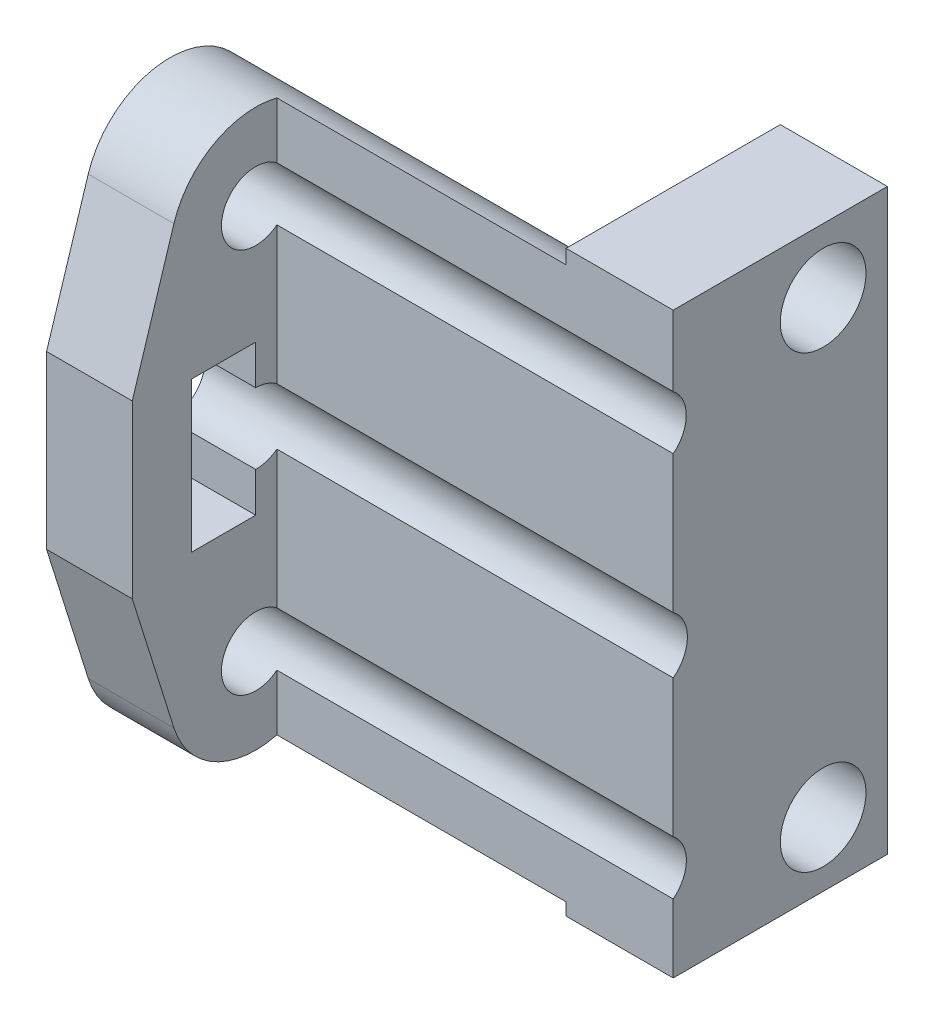
ISO-10303-21;
HEADER;
FILE_DESCRIPTION(('STEP AP214'),'2;1');
FILE_NAME('part.step','',(''),(''),'','','');
FILE_SCHEMA(('AUTOMOTIVE_DESIGN { 1 0 10303 214 1 1 1 1 }'));
ENDSEC;
DATA;
#1=APPLICATION_CONTEXT('core data for automotive mechanical design processes');
#2=APPLICATION_PROTOCOL_DEFINITION('international standard','automotive_design',2000,#1);
#3=PRODUCT_CONTEXT('',#1,'mechanical');
#4=PRODUCT('Part','Part','',(#3));
#5=PRODUCT_RELATED_PRODUCT_CATEGORY('part','',(#4));
#6=PRODUCT_DEFINITION_FORMATION('','',#4);
#7=PRODUCT_DEFINITION_CONTEXT('part definition',#1,'design');
#8=PRODUCT_DEFINITION('design','',#6,#7);
#9=PRODUCT_DEFINITION_SHAPE('','',#8);
#10=(LENGTH_UNIT() NAMED_UNIT(*) SI_UNIT(.MILLI.,.METRE.));
#11=(NAMED_UNIT(*) PLANE_ANGLE_UNIT() SI_UNIT($,.RADIAN.));
#12=(NAMED_UNIT(*) SI_UNIT($,.STERADIAN.) SOLID_ANGLE_UNIT());
#13=UNCERTAINTY_MEASURE_WITH_UNIT(LENGTH_MEASURE(1.E-05),#10,'distance_accuracy_value','');
#14=(GEOMETRIC_REPRESENTATION_CONTEXT(3) GLOBAL_UNCERTAINTY_ASSIGNED_CONTEXT((#13)) GLOBAL_UNIT_ASSIGNED_CONTEXT((#10,
#11,#12)) REPRESENTATION_CONTEXT('',''));
#15=CARTESIAN_POINT('',(0.,0.,0.));
#16=DIRECTION('',(0.,0.,1.));
#17=DIRECTION('',(1.,0.,0.));
#18=AXIS2_PLACEMENT_3D('',#15,#16,#17);
#19=CARTESIAN_POINT('',(0.,0.,4.));
#20=DIRECTION('',(0.,0.,1.));
#21=DIRECTION('',(1.,0.,0.));
#22=AXIS2_PLACEMENT_3D('',#19,#20,#21);
#23=PLANE('',#22);
#24=DIRECTION('',(-1.,0.,0.));
#25=VECTOR('',#24,1.);
#26=CARTESIAN_POINT('',(5.,212.675960946717,4.));
#27=LINE('',#26,#25);
#28=CARTESIAN_POINT('',(5.,212.675960946717,4.));
#29=VERTEX_POINT('',#28);
#30=CARTESIAN_POINT('',(-13.5,212.675960946717,4.));
#31=VERTEX_POINT('',#30);
#32=EDGE_CURVE('E258',#29,#31,#27,.T.);
#33=ORIENTED_EDGE('',*,*,#32,.F.);
#34=DIRECTION('',(0.,1.,0.));
#35=VECTOR('',#34,1.);
#36=CARTESIAN_POINT('',(5.,215.968429512973,4.));
#37=LINE('',#36,#35);
#38=CARTESIAN_POINT('',(5.,215.968429512973,4.));
#39=VERTEX_POINT('',#38);
#40=EDGE_CURVE('E335',#29,#39,#37,.T.);
#41=ORIENTED_EDGE('',*,*,#40,.T.);
#42=DIRECTION('',(-1.,0.,0.));
#43=VECTOR('',#42,1.);
#44=CARTESIAN_POINT('',(0.,215.968429512973,4.));
#45=LINE('',#44,#43);
#46=CARTESIAN_POINT('',(0.,215.968429512973,4.));
#47=VERTEX_POINT('',#46);
#48=EDGE_CURVE('E339',#39,#47,#45,.T.);
#49=ORIENTED_EDGE('',*,*,#48,.T.);
#50=DIRECTION('',(0.,-1.,0.));
#51=VECTOR('',#50,1.);
#52=CARTESIAN_POINT('',(0.,0.,4.));
#53=LINE('',#52,#51);
#54=CARTESIAN_POINT('',(0.,215.298948749305,4.));
#55=VERTEX_POINT('',#54);
#56=EDGE_CURVE('E313',#47,#55,#53,.T.);
#57=ORIENTED_EDGE('',*,*,#56,.T.);
#58=DIRECTION('',(-1.,0.,0.));
#59=VECTOR('',#58,1.);
#60=CARTESIAN_POINT('',(0.,215.298948749305,4.));
#61=LINE('',#60,#59);
#62=CARTESIAN_POINT('',(-13.5,215.298948749305,4.));
#63=VERTEX_POINT('',#62);
#64=EDGE_CURVE('E308',#63,#55,#61,.F.);
#65=ORIENTED_EDGE('',*,*,#64,.F.);
#66=DIRECTION('',(0.,1.,0.));
#67=VECTOR('',#66,1.);
#68=CARTESIAN_POINT('',(-13.5,215.968429512973,4.));
#69=LINE('',#68,#67);
#70=EDGE_CURVE('E316',#31,#63,#69,.T.);
#71=ORIENTED_EDGE('',*,*,#70,.F.);
#72=EDGE_LOOP('',(#33,#41,#49,#57,#65,#71));
#73=FACE_BOUND('',#72,.T.);
#74=ADVANCED_FACE('F33',(#73),#23,.T.);
#75=DIRECTION('',(-1.,0.,0.));
#76=VECTOR('',#75,1.);
#77=CARTESIAN_POINT('',(5.,194.682773282847,4.));
#78=LINE('',#77,#76);
#79=CARTESIAN_POINT('',(5.,194.682773282847,4.));
#80=VERTEX_POINT('',#79);
#81=CARTESIAN_POINT('',(-13.5,194.682773282847,4.));
#82=VERTEX_POINT('',#81);
#83=EDGE_CURVE('E254',#80,#82,#78,.T.);
#84=ORIENTED_EDGE('',*,*,#83,.F.);
#85=CARTESIAN_POINT('',(5.,201.101680385271,4.));
#86=VERTEX_POINT('',#85);
#87=EDGE_CURVE('E340',#80,#86,#37,.T.);
#88=ORIENTED_EDGE('',*,*,#87,.T.);
#89=DIRECTION('',(-1.,0.,0.));
#90=VECTOR('',#89,1.);
#91=CARTESIAN_POINT('',(5.,201.101680385271,4.));
#92=LINE('',#91,#90);
#93=CARTESIAN_POINT('',(-13.5,201.101680385271,4.));
#94=VERTEX_POINT('',#93);
#95=EDGE_CURVE('E242',#94,#86,#92,.F.);
#96=ORIENTED_EDGE('',*,*,#95,.F.);
#97=EDGE_CURVE('E327',#82,#94,#69,.T.);
#98=ORIENTED_EDGE('',*,*,#97,.F.);
#99=EDGE_LOOP('',(#84,#88,#96,#98));
#100=FACE_BOUND('',#99,.T.);
#101=ADVANCED_FACE('F430',(#100),#23,.T.);
#102=DIRECTION('',(-1.,0.,0.));
#103=VECTOR('',#102,1.);
#104=CARTESIAN_POINT('',(5.,210.166663095721,4.));
#105=LINE('',#104,#103);
#106=CARTESIAN_POINT('',(-13.5,210.166663095721,4.));
#107=VERTEX_POINT('',#106);
#108=CARTESIAN_POINT('',(5.,210.166663095721,4.));
#109=VERTEX_POINT('',#108);
#110=EDGE_CURVE('E256',#107,#109,#105,.F.);
#111=ORIENTED_EDGE('',*,*,#110,.F.);
#112=CARTESIAN_POINT('',(-13.5,203.744996753809,4.));
#113=VERTEX_POINT('',#112);
#114=EDGE_CURVE('E458',#113,#107,#69,.T.);
#115=ORIENTED_EDGE('',*,*,#114,.F.);
#116=DIRECTION('',(-1.,0.,0.));
#117=VECTOR('',#116,1.);
#118=CARTESIAN_POINT('',(5.,203.744996753809,4.));
#119=LINE('',#118,#117);
#120=CARTESIAN_POINT('',(5.,203.744996753809,4.));
#121=VERTEX_POINT('',#120);
#122=EDGE_CURVE('E250',#121,#113,#119,.T.);
#123=ORIENTED_EDGE('',*,*,#122,.F.);
#124=EDGE_CURVE('E425',#121,#109,#37,.T.);
#125=ORIENTED_EDGE('',*,*,#124,.T.);
#126=EDGE_LOOP('',(#111,#115,#123,#125));
#127=FACE_BOUND('',#126,.T.);
#128=ADVANCED_FACE('F520',(#127),#23,.T.);
#129=CARTESIAN_POINT('',(0.,215.968429512973,-5.99999999999999));
#130=DIRECTION('',(0.,1.,0.));
#131=DIRECTION('',(0.,0.,1.));
#132=AXIS2_PLACEMENT_3D('',#129,#130,#131);
#133=PLANE('',#132);
#134=DIRECTION('',(0.,0.,1.));
#135=VECTOR('',#134,1.);
#136=CARTESIAN_POINT('',(0.,215.968429512973,-5.99999999999999));
#137=LINE('',#136,#135);
#138=CARTESIAN_POINT('',(0.,215.968429512973,-5.99999999999999));
#139=VERTEX_POINT('',#138);
#140=EDGE_CURVE('E356',#139,#47,#137,.T.);
#141=ORIENTED_EDGE('',*,*,#140,.T.);
#142=ORIENTED_EDGE('',*,*,#48,.F.);
#143=DIRECTION('',(0.,0.,1.));
#144=VECTOR('',#143,1.);
#145=CARTESIAN_POINT('',(5.,215.968429512973,-5.99999999999999));
#146=LINE('',#145,#144);
#147=CARTESIAN_POINT('',(5.,215.968429512973,-5.99999999999999));
#148=VERTEX_POINT('',#147);
#149=EDGE_CURVE('E359',#148,#39,#146,.T.);
#150=ORIENTED_EDGE('',*,*,#149,.F.);
#151=DIRECTION('',(-1.,0.,0.));
#152=VECTOR('',#151,1.);
#153=CARTESIAN_POINT('',(0.,215.968429512973,-5.99999999999999));
#154=LINE('',#153,#152);
#155=EDGE_CURVE('E352',#148,#139,#154,.T.);
#156=ORIENTED_EDGE('',*,*,#155,.T.);
#157=EDGE_LOOP('',(#141,#142,#150,#156));
#158=FACE_BOUND('',#157,.T.);
#159=ADVANCED_FACE('F443',(#158),#133,.T.);
#160=CARTESIAN_POINT('',(0.,188.968429512971,-5.99999999999999));
#161=DIRECTION('',(0.,-1.,0.));
#162=DIRECTION('',(0.,0.,-1.));
#163=AXIS2_PLACEMENT_3D('',#160,#161,#162);
#164=PLANE('',#163);
#165=DIRECTION('',(1.,0.,0.));
#166=VECTOR('',#165,1.);
#167=CARTESIAN_POINT('',(0.,188.968429512971,4.));
#168=LINE('',#167,#166);
#169=CARTESIAN_POINT('',(0.,188.968429512971,4.));
#170=VERTEX_POINT('',#169);
#171=CARTESIAN_POINT('',(5.,188.968429512971,4.));
#172=VERTEX_POINT('',#171);
#173=EDGE_CURVE('E331',#170,#172,#168,.T.);
#174=ORIENTED_EDGE('',*,*,#173,.F.);
#175=DIRECTION('',(0.,0.,1.));
#176=VECTOR('',#175,1.);
#177=CARTESIAN_POINT('',(0.,188.968429512971,-5.99999999999999));
#178=LINE('',#177,#176);
#179=CARTESIAN_POINT('',(0.,188.968429512971,-5.99999999999999));
#180=VERTEX_POINT('',#179);
#181=EDGE_CURVE('E355',#180,#170,#178,.T.);
#182=ORIENTED_EDGE('',*,*,#181,.F.);
#183=DIRECTION('',(1.,0.,0.));
#184=VECTOR('',#183,1.);
#185=CARTESIAN_POINT('',(0.,188.968429512971,-5.99999999999999));
#186=LINE('',#185,#184);
#187=CARTESIAN_POINT('',(5.,188.968429512971,-5.99999999999999));
#188=VERTEX_POINT('',#187);
#189=EDGE_CURVE('E346',#180,#188,#186,.T.);
#190=ORIENTED_EDGE('',*,*,#189,.T.);
#191=DIRECTION('',(0.,0.,1.));
#192=VECTOR('',#191,1.);
#193=CARTESIAN_POINT('',(5.,188.968429512971,-5.99999999999999));
#194=LINE('',#193,#192);
#195=EDGE_CURVE('E362',#188,#172,#194,.T.);
#196=ORIENTED_EDGE('',*,*,#195,.T.);
#197=EDGE_LOOP('',(#174,#182,#190,#196));
#198=FACE_BOUND('',#197,.T.);
#199=ADVANCED_FACE('F475',(#198),#164,.T.);
#200=CARTESIAN_POINT('',(0.,215.968429512973,-5.99999999999999));
#201=DIRECTION('',(-1.,0.,0.));
#202=DIRECTION('',(0.,0.,1.));
#203=AXIS2_PLACEMENT_3D('',#200,#201,#202);
#204=PLANE('',#203);
#205=CARTESIAN_POINT('',(0.,212.968429512973,-2.99999999999999));
#206=DIRECTION('',(-1.,0.,0.));
#207=DIRECTION('',(0.,0.,1.));
#208=AXIS2_PLACEMENT_3D('',#205,#206,#207);
#209=CIRCLE('',#208,2.);
#210=CARTESIAN_POINT('',(0.,212.968429512973,-0.999999999999981));
#211=VERTEX_POINT('',#210);
#212=EDGE_CURVE('E394',#211,#211,#209,.T.);
#213=ORIENTED_EDGE('',*,*,#212,.F.);
#214=EDGE_LOOP('',(#213));
#215=FACE_BOUND('',#214,.T.);
#216=CARTESIAN_POINT('',(0.,191.968429512971,-2.99999999999999));
#217=DIRECTION('',(-1.,0.,0.));
#218=DIRECTION('',(0.,0.,-1.));
#219=AXIS2_PLACEMENT_3D('',#216,#217,#218);
#220=CIRCLE('',#219,2.);
#221=CARTESIAN_POINT('',(0.,191.968429512971,-4.99999999999999));
#222=VERTEX_POINT('',#221);
#223=EDGE_CURVE('E400',#222,#222,#220,.T.);
#224=ORIENTED_EDGE('',*,*,#223,.F.);
#225=EDGE_LOOP('',(#224));
#226=FACE_BOUND('',#225,.T.);
#227=DIRECTION('',(0.,-1.,0.));
#228=VECTOR('',#227,1.);
#229=CARTESIAN_POINT('',(0.,215.968429512973,0.));
#230=LINE('',#229,#228);
#231=CARTESIAN_POINT('',(0.,208.891636686407,0.));
#232=VERTEX_POINT('',#231);
#233=CARTESIAN_POINT('',(0.,195.954067859957,0.));
#234=VERTEX_POINT('',#233);
#235=EDGE_CURVE('E324',#232,#234,#230,.T.);
#236=ORIENTED_EDGE('',*,*,#235,.F.);
#237=DIRECTION('',(0.,0.954001475587167,0.299801908895704));
#238=VECTOR('',#237,1.);
#239=CARTESIAN_POINT('',(0.,212.621120569874,1.17201746126317));
#240=LINE('',#239,#238);
#241=CARTESIAN_POINT('',(0.,212.621120569874,1.17201746126317));
#242=VERTEX_POINT('',#241);
#243=EDGE_CURVE('E261',#232,#242,#240,.T.);
#244=ORIENTED_EDGE('',*,*,#243,.T.);
#245=CARTESIAN_POINT('',(0.,211.421312021219,4.98993553274779));
#246=DIRECTION('',(1.,0.,0.));
#247=DIRECTION('',(0.,0.,1.));
#248=AXIS2_PLACEMENT_3D('',#245,#246,#247);
#249=CIRCLE('',#248,4.00200436706325);
#250=EDGE_CURVE('E264',#242,#55,#249,.T.);
#251=ORIENTED_EDGE('',*,*,#250,.T.);
#252=ORIENTED_EDGE('',*,*,#56,.F.);
#253=ORIENTED_EDGE('',*,*,#140,.F.);
#254=DIRECTION('',(0.,-1.,0.));
#255=VECTOR('',#254,1.);
#256=CARTESIAN_POINT('',(0.,215.968429512973,-5.99999999999999));
#257=LINE('',#256,#255);
#258=EDGE_CURVE('E343',#139,#180,#257,.T.);
#259=ORIENTED_EDGE('',*,*,#258,.T.);
#260=ORIENTED_EDGE('',*,*,#181,.T.);
#261=DIRECTION('',(0.,-1.,0.));
#262=VECTOR('',#261,1.);
#263=CARTESIAN_POINT('',(0.,0.,4.));
#264=LINE('',#263,#262);
#265=CARTESIAN_POINT('',(0.,189.546702452947,4.));
#266=VERTEX_POINT('',#265);
#267=EDGE_CURVE('E310',#266,#170,#264,.T.);
#268=ORIENTED_EDGE('',*,*,#267,.F.);
#269=CARTESIAN_POINT('',(0.,193.423193450589,4.98825027494013));
#270=DIRECTION('',(1.,0.,0.));
#271=DIRECTION('',(0.,0.,1.));
#272=AXIS2_PLACEMENT_3D('',#269,#270,#271);
#273=CIRCLE('',#272,4.00047760407701);
#274=CARTESIAN_POINT('',(0.,192.224272590052,1.171653645626));
#275=VERTEX_POINT('',#274);
#276=EDGE_CURVE('E283',#266,#275,#273,.T.);
#277=ORIENTED_EDGE('',*,*,#276,.T.);
#278=DIRECTION('',(0.,0.954035244547933,-0.299694431313573));
#279=VECTOR('',#278,1.);
#280=CARTESIAN_POINT('',(0.,195.954067859957,0.));
#281=LINE('',#280,#279);
#282=EDGE_CURVE('E285',#275,#234,#281,.T.);
#283=ORIENTED_EDGE('',*,*,#282,.T.);
#284=EDGE_LOOP('',(#236,#244,#251,#252,#253,#259,#260,#268,#277,#283));
#285=FACE_BOUND('',#284,.T.);
#286=ADVANCED_FACE('F35',(#215,#226,#285),#204,.T.);
#287=CARTESIAN_POINT('',(5.,215.968429512973,-5.99999999999999));
#288=DIRECTION('',(1.,0.,0.));
#289=DIRECTION('',(0.,0.,-1.));
#290=AXIS2_PLACEMENT_3D('',#287,#288,#289);
#291=PLANE('',#290);
#292=CARTESIAN_POINT('',(5.,212.968429512973,-2.99999999999999));
#293=DIRECTION('',(1.,0.,0.));
#294=DIRECTION('',(0.,0.,-1.));
#295=AXIS2_PLACEMENT_3D('',#292,#293,#294);
#296=CIRCLE('',#295,2.);
#297=CARTESIAN_POINT('',(5.,212.968429512973,-4.99999999999999));
#298=VERTEX_POINT('',#297);
#299=EDGE_CURVE('E37',#298,#298,#296,.T.);
#300=ORIENTED_EDGE('',*,*,#299,.F.);
#301=EDGE_LOOP('',(#300));
#302=FACE_BOUND('',#301,.T.);
#303=CARTESIAN_POINT('',(5.,191.968429512971,-2.99999999999999));
#304=DIRECTION('',(1.,0.,0.));
#305=DIRECTION('',(0.,0.,-1.));
#306=AXIS2_PLACEMENT_3D('',#303,#304,#305);
#307=CIRCLE('',#306,2.);
#308=CARTESIAN_POINT('',(5.,191.968429512971,-4.99999999999999));
#309=VERTEX_POINT('',#308);
#310=EDGE_CURVE('E392',#309,#309,#307,.T.);
#311=ORIENTED_EDGE('',*,*,#310,.F.);
#312=EDGE_LOOP('',(#311));
#313=FACE_BOUND('',#312,.T.);
#314=CARTESIAN_POINT('',(5.,211.421312021219,4.98993553274779));
#315=DIRECTION('',(-1.,0.,0.));
#316=DIRECTION('',(0.,0.,1.));
#317=AXIS2_PLACEMENT_3D('',#314,#315,#316);
#318=CIRCLE('',#317,1.59816028146427);
#319=EDGE_CURVE('E413',#29,#109,#318,.T.);
#320=ORIENTED_EDGE('',*,*,#319,.T.);
#321=ORIENTED_EDGE('',*,*,#124,.F.);
#322=CARTESIAN_POINT('',(5.,202.42333856954,4.98931929967281));
#323=DIRECTION('',(-1.,0.,0.));
#324=DIRECTION('',(0.,0.,1.));
#325=AXIS2_PLACEMENT_3D('',#322,#323,#324);
#326=CIRCLE('',#325,1.65091884499224);
#327=EDGE_CURVE('E239',#121,#86,#326,.T.);
#328=ORIENTED_EDGE('',*,*,#327,.T.);
#329=ORIENTED_EDGE('',*,*,#87,.F.);
#330=CARTESIAN_POINT('',(5.,193.423193450589,4.98825027494013));
#331=DIRECTION('',(-1.,0.,0.));
#332=DIRECTION('',(0.,0.,1.));
#333=AXIS2_PLACEMENT_3D('',#330,#331,#332);
#334=CIRCLE('',#333,1.60099342901518);
#335=CARTESIAN_POINT('',(5.,192.163613618331,4.));
#336=VERTEX_POINT('',#335);
#337=EDGE_CURVE('E407',#80,#336,#334,.T.);
#338=ORIENTED_EDGE('',*,*,#337,.T.);
#339=EDGE_CURVE('E336',#172,#336,#37,.T.);
#340=ORIENTED_EDGE('',*,*,#339,.F.);
#341=ORIENTED_EDGE('',*,*,#195,.F.);
#342=DIRECTION('',(0.,1.,0.));
#343=VECTOR('',#342,1.);
#344=CARTESIAN_POINT('',(5.,215.968429512973,-5.99999999999999));
#345=LINE('',#344,#343);
#346=EDGE_CURVE('E349',#188,#148,#345,.T.);
#347=ORIENTED_EDGE('',*,*,#346,.T.);
#348=ORIENTED_EDGE('',*,*,#149,.T.);
#349=ORIENTED_EDGE('',*,*,#40,.F.);
#350=EDGE_LOOP('',(#320,#321,#328,#329,#338,#340,#341,#347,#348,#349));
#351=FACE_BOUND('',#350,.T.);
#352=ADVANCED_FACE('F423',(#302,#313,#351),#291,.T.);
#353=CARTESIAN_POINT('',(0.,0.,-5.99999999999999));
#354=DIRECTION('',(0.,0.,1.));
#355=DIRECTION('',(1.,0.,0.));
#356=AXIS2_PLACEMENT_3D('',#353,#354,#355);
#357=PLANE('',#356);
#358=ORIENTED_EDGE('',*,*,#258,.F.);
#359=ORIENTED_EDGE('',*,*,#155,.F.);
#360=ORIENTED_EDGE('',*,*,#346,.F.);
#361=ORIENTED_EDGE('',*,*,#189,.F.);
#362=EDGE_LOOP('',(#358,#359,#360,#361));
#363=FACE_BOUND('',#362,.T.);
#364=ADVANCED_FACE('F474',(#363),#357,.F.);
#365=DIRECTION('',(-1.,0.,0.));
#366=VECTOR('',#365,1.);
#367=CARTESIAN_POINT('',(5.,192.163613618331,4.));
#368=LINE('',#367,#366);
#369=CARTESIAN_POINT('',(-13.5,192.163613618331,4.));
#370=VERTEX_POINT('',#369);
#371=EDGE_CURVE('E252',#370,#336,#368,.F.);
#372=ORIENTED_EDGE('',*,*,#371,.F.);
#373=CARTESIAN_POINT('',(-13.5,189.546702452947,4.));
#374=VERTEX_POINT('',#373);
#375=EDGE_CURVE('E321',#374,#370,#69,.T.);
#376=ORIENTED_EDGE('',*,*,#375,.F.);
#377=DIRECTION('',(-1.,0.,0.));
#378=VECTOR('',#377,1.);
#379=CARTESIAN_POINT('',(0.,189.546702452947,4.));
#380=LINE('',#379,#378);
#381=EDGE_CURVE('E306',#266,#374,#380,.T.);
#382=ORIENTED_EDGE('',*,*,#381,.F.);
#383=ORIENTED_EDGE('',*,*,#267,.T.);
#384=ORIENTED_EDGE('',*,*,#173,.T.);
#385=ORIENTED_EDGE('',*,*,#339,.T.);
#386=EDGE_LOOP('',(#372,#376,#382,#383,#384,#385));
#387=FACE_BOUND('',#386,.T.);
#388=ADVANCED_FACE('F467',(#387),#23,.T.);
#389=CARTESIAN_POINT('',(-17.5,215.968429512973,0.));
#390=DIRECTION('',(0.,0.,1.));
#391=DIRECTION('',(1.,0.,0.));
#392=AXIS2_PLACEMENT_3D('',#389,#390,#391);
#393=PLANE('',#392);
#394=DIRECTION('',(0.,-1.,0.));
#395=VECTOR('',#394,1.);
#396=CARTESIAN_POINT('',(-17.5,215.968429512973,0.));
#397=LINE('',#396,#395);
#398=CARTESIAN_POINT('',(-17.5,208.891636686407,0.));
#399=VERTEX_POINT('',#398);
#400=CARTESIAN_POINT('',(-17.5,195.954067859957,0.));
#401=VERTEX_POINT('',#400);
#402=EDGE_CURVE('E328',#399,#401,#397,.T.);
#403=ORIENTED_EDGE('',*,*,#402,.F.);
#404=DIRECTION('',(-1.,0.,0.));
#405=VECTOR('',#404,1.);
#406=CARTESIAN_POINT('',(0.,208.891636686407,0.));
#407=LINE('',#406,#405);
#408=EDGE_CURVE('E268',#232,#399,#407,.T.);
#409=ORIENTED_EDGE('',*,*,#408,.F.);
#410=ORIENTED_EDGE('',*,*,#235,.T.);
#411=DIRECTION('',(-1.,0.,0.));
#412=VECTOR('',#411,1.);
#413=CARTESIAN_POINT('',(0.,195.954067859957,0.));
#414=LINE('',#413,#412);
#415=EDGE_CURVE('E297',#234,#401,#414,.T.);
#416=ORIENTED_EDGE('',*,*,#415,.T.);
#417=EDGE_LOOP('',(#403,#409,#410,#416));
#418=FACE_BOUND('',#417,.T.);
#419=ADVANCED_FACE('F499',(#418),#393,.F.);
#420=CARTESIAN_POINT('',(-17.5,0.,0.));
#421=DIRECTION('',(-1.,0.,0.));
#422=DIRECTION('',(0.,0.,1.));
#423=AXIS2_PLACEMENT_3D('',#420,#421,#422);
#424=PLANE('',#423);
#425=CARTESIAN_POINT('',(-17.5,211.421312021219,4.98993553274779));
#426=DIRECTION('',(-1.,0.,0.));
#427=DIRECTION('',(0.,0.,1.));
#428=AXIS2_PLACEMENT_3D('',#425,#426,#427);
#429=CIRCLE('',#428,1.59816028146427);
#430=CARTESIAN_POINT('',(-17.5,211.421312021219,6.58809581421206));
#431=VERTEX_POINT('',#430);
#432=EDGE_CURVE('E398',#431,#431,#429,.T.);
#433=ORIENTED_EDGE('',*,*,#432,.F.);
#434=EDGE_LOOP('',(#433));
#435=FACE_BOUND('',#434,.T.);
#436=CARTESIAN_POINT('',(-17.5,193.423193450589,4.98825027494013));
#437=DIRECTION('',(-1.,0.,0.));
#438=DIRECTION('',(0.,0.,1.));
#439=AXIS2_PLACEMENT_3D('',#436,#437,#438);
#440=CIRCLE('',#439,1.60099342901518);
#441=CARTESIAN_POINT('',(-17.5,193.423193450589,6.58924370395532));
#442=VERTEX_POINT('',#441);
#443=EDGE_CURVE('E410',#442,#442,#440,.T.);
#444=ORIENTED_EDGE('',*,*,#443,.F.);
#445=EDGE_LOOP('',(#444));
#446=FACE_BOUND('',#445,.T.);
#447=DIRECTION('',(0.,-1.,0.));
#448=VECTOR('',#447,1.);
#449=CARTESIAN_POINT('',(-17.5,205.92333856954,4.98931929967309));
#450=LINE('',#449,#448);
#451=CARTESIAN_POINT('',(-17.5,205.92333856954,4.98931929967309));
#452=VERTEX_POINT('',#451);
#453=CARTESIAN_POINT('',(-17.5,204.074257414532,4.98931929967309));
#454=VERTEX_POINT('',#453);
#455=EDGE_CURVE('E50',#452,#454,#450,.T.);
#456=ORIENTED_EDGE('',*,*,#455,.F.);
#457=DIRECTION('',(0.,0.,-1.));
#458=VECTOR('',#457,1.);
#459=CARTESIAN_POINT('',(-17.5,205.92333856954,4.98931929967309));
#460=LINE('',#459,#458);
#461=CARTESIAN_POINT('',(-17.5,205.92333856954,7.98931929967309));
#462=VERTEX_POINT('',#461);
#463=EDGE_CURVE('E236',#462,#452,#460,.T.);
#464=ORIENTED_EDGE('',*,*,#463,.F.);
#465=DIRECTION('',(0.,1.,0.));
#466=VECTOR('',#465,1.);
#467=CARTESIAN_POINT('',(-17.5,205.92333856954,7.98931929967309));
#468=LINE('',#467,#466);
#469=CARTESIAN_POINT('',(-17.5,198.92333856954,7.98931929967309));
#470=VERTEX_POINT('',#469);
#471=EDGE_CURVE('E230',#470,#462,#468,.T.);
#472=ORIENTED_EDGE('',*,*,#471,.F.);
#473=DIRECTION('',(0.,0.,1.));
#474=VECTOR('',#473,1.);
#475=CARTESIAN_POINT('',(-17.5,198.92333856954,4.98931929967309));
#476=LINE('',#475,#474);
#477=CARTESIAN_POINT('',(-17.5,198.92333856954,4.98931929967309));
#478=VERTEX_POINT('',#477);
#479=EDGE_CURVE('E228',#478,#470,#476,.T.);
#480=ORIENTED_EDGE('',*,*,#479,.F.);
#481=DIRECTION('',(0.,-1.,0.));
#482=VECTOR('',#481,1.);
#483=CARTESIAN_POINT('',(-17.5,200.772419724548,4.98931929967309));
#484=LINE('',#483,#482);
#485=CARTESIAN_POINT('',(-17.5,200.772419724548,4.98931929967309));
#486=VERTEX_POINT('',#485);
#487=EDGE_CURVE('E211',#486,#478,#484,.T.);
#488=ORIENTED_EDGE('',*,*,#487,.F.);
#489=CARTESIAN_POINT('',(-17.5,202.42333856954,4.98931929967281));
#490=DIRECTION('',(-1.,0.,0.));
#491=DIRECTION('',(0.,0.,1.));
#492=AXIS2_PLACEMENT_3D('',#489,#490,#491);
#493=CIRCLE('',#492,1.65091884499224);
#494=EDGE_CURVE('E220',#454,#486,#493,.T.);
#495=ORIENTED_EDGE('',*,*,#494,.F.);
#496=EDGE_LOOP('',(#456,#464,#472,#480,#488,#495));
#497=FACE_BOUND('',#496,.T.);
#498=DIRECTION('',(0.,-0.954143678077247,0.29934902970483));
#499=VECTOR('',#498,1.);
#500=CARTESIAN_POINT('',(-17.5,206.42333875953,10.752320108329));
#501=LINE('',#500,#499);
#502=CARTESIAN_POINT('',(-17.5,212.619308145374,8.80842269921872));
#503=VERTEX_POINT('',#502);
#504=CARTESIAN_POINT('',(-17.5,206.42333875953,10.752320108329));
#505=VERTEX_POINT('',#504);
#506=EDGE_CURVE('E265',#503,#505,#501,.T.);
#507=ORIENTED_EDGE('',*,*,#506,.F.);
#508=CARTESIAN_POINT('',(-17.5,211.421312021219,4.98993553274779));
#509=DIRECTION('',(1.,0.,0.));
#510=DIRECTION('',(0.,0.,1.));
#511=AXIS2_PLACEMENT_3D('',#508,#509,#510);
#512=CIRCLE('',#511,4.00200436706325);
#513=CARTESIAN_POINT('',(-17.5,212.621120569874,1.17201746126317));
#514=VERTEX_POINT('',#513);
#515=EDGE_CURVE('E272',#514,#503,#512,.T.);
#516=ORIENTED_EDGE('',*,*,#515,.F.);
#517=DIRECTION('',(0.,0.954001475587167,0.299801908895704));
#518=VECTOR('',#517,1.);
#519=CARTESIAN_POINT('',(-17.5,212.621120569874,1.17201746126317));
#520=LINE('',#519,#518);
#521=EDGE_CURVE('E269',#399,#514,#520,.T.);
#522=ORIENTED_EDGE('',*,*,#521,.F.);
#523=ORIENTED_EDGE('',*,*,#402,.T.);
#524=DIRECTION('',(0.,0.954035244547933,-0.299694431313573));
#525=VECTOR('',#524,1.);
#526=CARTESIAN_POINT('',(-17.5,195.954067859957,0.));
#527=LINE('',#526,#525);
#528=CARTESIAN_POINT('',(-17.5,192.224272590052,1.171653645626));
#529=VERTEX_POINT('',#528);
#530=EDGE_CURVE('E292',#529,#401,#527,.T.);
#531=ORIENTED_EDGE('',*,*,#530,.F.);
#532=CARTESIAN_POINT('',(-17.5,193.423193450589,4.98825027494013));
#533=DIRECTION('',(1.,0.,0.));
#534=DIRECTION('',(0.,0.,1.));
#535=AXIS2_PLACEMENT_3D('',#532,#533,#534);
#536=CIRCLE('',#535,4.00047760407701);
#537=CARTESIAN_POINT('',(-17.5,192.224194718447,8.80482244130132));
#538=VERTEX_POINT('',#537);
#539=EDGE_CURVE('E260',#538,#529,#536,.T.);
#540=ORIENTED_EDGE('',*,*,#539,.F.);
#541=DIRECTION('',(0.,-0.954029129539831,-0.299713896890804));
#542=VECTOR('',#541,1.);
#543=CARTESIAN_POINT('',(-17.5,192.224194718447,8.80482244130132));
#544=LINE('',#543,#542);
#545=CARTESIAN_POINT('',(-17.5,198.42333837955,10.752320108329));
#546=VERTEX_POINT('',#545);
#547=EDGE_CURVE('E286',#546,#538,#544,.T.);
#548=ORIENTED_EDGE('',*,*,#547,.F.);
#549=DIRECTION('',(0.,-1.,0.));
#550=VECTOR('',#549,1.);
#551=CARTESIAN_POINT('',(-17.5,215.968429512973,10.752320108329));
#552=LINE('',#551,#550);
#553=EDGE_CURVE('E317',#505,#546,#552,.T.);
#554=ORIENTED_EDGE('',*,*,#553,.F.);
#555=EDGE_LOOP('',(#507,#516,#522,#523,#531,#540,#548,#554));
#556=FACE_BOUND('',#555,.T.);
#557=ADVANCED_FACE('F224',(#435,#446,#497,#556),#424,.T.);
#558=CARTESIAN_POINT('',(-13.5,215.968429512973,10.752320108329));
#559=DIRECTION('',(-1.,0.,0.));
#560=DIRECTION('',(0.,-1.,0.));
#561=AXIS2_PLACEMENT_3D('',#558,#559,#560);
#562=PLANE('',#561);
#563=ORIENTED_EDGE('',*,*,#114,.T.);
#564=CARTESIAN_POINT('',(-13.5,211.421312021219,4.98993553274779));
#565=DIRECTION('',(-1.,0.,0.));
#566=DIRECTION('',(0.,-1.,0.));
#567=AXIS2_PLACEMENT_3D('',#564,#565,#566);
#568=CIRCLE('',#567,1.59816028146427);
#569=EDGE_CURVE('E11',#107,#31,#568,.T.);
#570=ORIENTED_EDGE('',*,*,#569,.T.);
#571=ORIENTED_EDGE('',*,*,#70,.T.);
#572=CARTESIAN_POINT('',(-13.5,211.421312021219,4.98993553274779));
#573=DIRECTION('',(-1.,0.,0.));
#574=DIRECTION('',(0.,-1.,0.));
#575=AXIS2_PLACEMENT_3D('',#572,#573,#574);
#576=CIRCLE('',#575,4.00200436706325);
#577=CARTESIAN_POINT('',(-13.5,212.619308145374,8.80842269921872));
#578=VERTEX_POINT('',#577);
#579=EDGE_CURVE('E372',#63,#578,#576,.F.);
#580=ORIENTED_EDGE('',*,*,#579,.T.);
#581=DIRECTION('',(0.,-0.954143678077247,0.29934902970483));
#582=VECTOR('',#581,1.);
#583=CARTESIAN_POINT('',(-13.5,215.11309544264,8.02603234766171));
#584=LINE('',#583,#582);
#585=CARTESIAN_POINT('',(-13.5,206.42333875953,10.752320108329));
#586=VERTEX_POINT('',#585);
#587=EDGE_CURVE('E303',#578,#586,#584,.T.);
#588=ORIENTED_EDGE('',*,*,#587,.T.);
#589=DIRECTION('',(0.,1.,0.));
#590=VECTOR('',#589,1.);
#591=CARTESIAN_POINT('',(-13.5,215.968429512973,10.752320108329));
#592=LINE('',#591,#590);
#593=CARTESIAN_POINT('',(-13.5,198.42333837955,10.752320108329));
#594=VERTEX_POINT('',#593);
#595=EDGE_CURVE('E320',#594,#586,#592,.T.);
#596=ORIENTED_EDGE('',*,*,#595,.F.);
#597=DIRECTION('',(0.,-0.954029129539832,-0.299713896890804));
#598=VECTOR('',#597,1.);
#599=CARTESIAN_POINT('',(-13.5,214.392381697886,15.7690895699334));
#600=LINE('',#599,#598);
#601=CARTESIAN_POINT('',(-13.5,192.224194718447,8.80482244130132));
#602=VERTEX_POINT('',#601);
#603=EDGE_CURVE('E279',#594,#602,#600,.T.);
#604=ORIENTED_EDGE('',*,*,#603,.T.);
#605=CARTESIAN_POINT('',(-13.5,193.423193450589,4.98825027494013));
#606=DIRECTION('',(-1.,0.,0.));
#607=DIRECTION('',(0.,-1.,0.));
#608=AXIS2_PLACEMENT_3D('',#605,#606,#607);
#609=CIRCLE('',#608,4.00047760407701);
#610=EDGE_CURVE('E369',#602,#374,#609,.F.);
#611=ORIENTED_EDGE('',*,*,#610,.T.);
#612=ORIENTED_EDGE('',*,*,#375,.T.);
#613=CARTESIAN_POINT('',(-13.5,193.423193450589,4.98825027494013));
#614=DIRECTION('',(-1.,0.,0.));
#615=DIRECTION('',(0.,-1.,0.));
#616=AXIS2_PLACEMENT_3D('',#613,#614,#615);
#617=CIRCLE('',#616,1.60099342901518);
#618=EDGE_CURVE('E42',#370,#82,#617,.T.);
#619=ORIENTED_EDGE('',*,*,#618,.T.);
#620=ORIENTED_EDGE('',*,*,#97,.T.);
#621=CARTESIAN_POINT('',(-13.5,202.42333856954,4.98931929967281));
#622=DIRECTION('',(-1.,0.,0.));
#623=DIRECTION('',(0.,-1.,0.));
#624=AXIS2_PLACEMENT_3D('',#621,#622,#623);
#625=CIRCLE('',#624,1.65091884499224);
#626=CARTESIAN_POINT('',(-13.5,200.772419724548,4.98931929967281));
#627=VERTEX_POINT('',#626);
#628=EDGE_CURVE('E375',#94,#627,#625,.T.);
#629=ORIENTED_EDGE('',*,*,#628,.T.);
#630=DIRECTION('',(0.,-1.,0.));
#631=VECTOR('',#630,1.);
#632=CARTESIAN_POINT('',(-13.5,215.968429512973,4.98931929967309));
#633=LINE('',#632,#631);
#634=CARTESIAN_POINT('',(-13.5,198.92333856954,4.98931929967309));
#635=VERTEX_POINT('',#634);
#636=EDGE_CURVE('E214',#627,#635,#633,.T.);
#637=ORIENTED_EDGE('',*,*,#636,.T.);
#638=DIRECTION('',(0.,0.,1.));
#639=VECTOR('',#638,1.);
#640=CARTESIAN_POINT('',(-13.5,198.92333856954,10.752320108329));
#641=LINE('',#640,#639);
#642=CARTESIAN_POINT('',(-13.5,198.92333856954,7.98931929967309));
#643=VERTEX_POINT('',#642);
#644=EDGE_CURVE('E379',#635,#643,#641,.T.);
#645=ORIENTED_EDGE('',*,*,#644,.T.);
#646=DIRECTION('',(0.,1.,0.));
#647=VECTOR('',#646,1.);
#648=CARTESIAN_POINT('',(-13.5,215.968429512973,7.98931929967309));
#649=LINE('',#648,#647);
#650=CARTESIAN_POINT('',(-13.5,205.92333856954,7.98931929967309));
#651=VERTEX_POINT('',#650);
#652=EDGE_CURVE('E382',#643,#651,#649,.T.);
#653=ORIENTED_EDGE('',*,*,#652,.T.);
#654=DIRECTION('',(0.,0.,-1.));
#655=VECTOR('',#654,1.);
#656=CARTESIAN_POINT('',(-13.5,205.92333856954,10.752320108329));
#657=LINE('',#656,#655);
#658=CARTESIAN_POINT('',(-13.5,205.92333856954,4.98931929967309));
#659=VERTEX_POINT('',#658);
#660=EDGE_CURVE('E385',#651,#659,#657,.T.);
#661=ORIENTED_EDGE('',*,*,#660,.T.);
#662=DIRECTION('',(0.,-1.,0.));
#663=VECTOR('',#662,1.);
#664=CARTESIAN_POINT('',(-13.5,215.968429512973,4.98931929967309));
#665=LINE('',#664,#663);
#666=CARTESIAN_POINT('',(-13.5,204.074257414532,4.98931929967309));
#667=VERTEX_POINT('',#666);
#668=EDGE_CURVE('E388',#659,#667,#665,.T.);
#669=ORIENTED_EDGE('',*,*,#668,.T.);
#670=EDGE_CURVE('E377',#667,#113,#625,.T.);
#671=ORIENTED_EDGE('',*,*,#670,.T.);
#672=EDGE_LOOP('',(#563,#570,#571,#580,#588,#596,#604,#611,#612,#619,#620,#629,#637,#645,#653,
#661,#669,#671));
#673=FACE_BOUND('',#672,.T.);
#674=ADVANCED_FACE('F456',(#673),#562,.F.);
#675=CARTESIAN_POINT('',(0.,0.,10.752320108329));
#676=DIRECTION('',(0.,0.,1.));
#677=DIRECTION('',(1.,0.,0.));
#678=AXIS2_PLACEMENT_3D('',#675,#676,#677);
#679=PLANE('',#678);
#680=DIRECTION('',(1.,0.,0.));
#681=VECTOR('',#680,1.);
#682=CARTESIAN_POINT('',(0.,206.42333875953,10.752320108329));
#683=LINE('',#682,#681);
#684=EDGE_CURVE('E367',#505,#586,#683,.T.);
#685=ORIENTED_EDGE('',*,*,#684,.F.);
#686=ORIENTED_EDGE('',*,*,#553,.T.);
#687=DIRECTION('',(-1.,0.,0.));
#688=VECTOR('',#687,1.);
#689=CARTESIAN_POINT('',(0.,198.42333837955,10.752320108329));
#690=LINE('',#689,#688);
#691=EDGE_CURVE('E358',#594,#546,#690,.T.);
#692=ORIENTED_EDGE('',*,*,#691,.F.);
#693=ORIENTED_EDGE('',*,*,#595,.T.);
#694=EDGE_LOOP('',(#685,#686,#692,#693));
#695=FACE_BOUND('',#694,.T.);
#696=ADVANCED_FACE('F487',(#695),#679,.T.);
#697=CARTESIAN_POINT('',(0.,192.224194718447,8.80482244130132));
#698=DIRECTION('',(0.,0.299713896890804,-0.954029129539832));
#699=DIRECTION('',(0.,0.954029129539832,0.299713896890804));
#700=AXIS2_PLACEMENT_3D('',#697,#698,#699);
#701=PLANE('',#700);
#702=ORIENTED_EDGE('',*,*,#691,.T.);
#703=ORIENTED_EDGE('',*,*,#547,.T.);
#704=DIRECTION('',(-1.,0.,0.));
#705=VECTOR('',#704,1.);
#706=CARTESIAN_POINT('',(0.,192.224194718447,8.80482244130132));
#707=LINE('',#706,#705);
#708=EDGE_CURVE('E273',#602,#538,#707,.T.);
#709=ORIENTED_EDGE('',*,*,#708,.F.);
#710=ORIENTED_EDGE('',*,*,#603,.F.);
#711=EDGE_LOOP('',(#702,#703,#709,#710));
#712=FACE_BOUND('',#711,.T.);
#713=ADVANCED_FACE('F483',(#712),#701,.F.);
#714=CARTESIAN_POINT('',(0.,193.423193450589,4.98825027494013));
#715=DIRECTION('',(-1.,0.,0.));
#716=DIRECTION('',(0.,0.,1.));
#717=AXIS2_PLACEMENT_3D('',#714,#715,#716);
#718=CYLINDRICAL_SURFACE('',#717,4.00047760407701);
#719=ORIENTED_EDGE('',*,*,#381,.T.);
#720=ORIENTED_EDGE('',*,*,#610,.F.);
#721=ORIENTED_EDGE('',*,*,#708,.T.);
#722=ORIENTED_EDGE('',*,*,#539,.T.);
#723=DIRECTION('',(-1.,0.,0.));
#724=VECTOR('',#723,1.);
#725=CARTESIAN_POINT('',(0.,192.224272590052,1.171653645626));
#726=LINE('',#725,#724);
#727=EDGE_CURVE('E289',#275,#529,#726,.T.);
#728=ORIENTED_EDGE('',*,*,#727,.F.);
#729=ORIENTED_EDGE('',*,*,#276,.F.);
#730=EDGE_LOOP('',(#719,#720,#721,#722,#728,#729));
#731=FACE_BOUND('',#730,.T.);
#732=ADVANCED_FACE('F478',(#731),#718,.T.);
#733=CARTESIAN_POINT('',(0.,195.954067859957,0.));
#734=DIRECTION('',(0.,0.299694431313573,0.954035244547933));
#735=DIRECTION('',(0.,-0.954035244547933,0.299694431313573));
#736=AXIS2_PLACEMENT_3D('',#733,#734,#735);
#737=PLANE('',#736);
#738=ORIENTED_EDGE('',*,*,#530,.T.);
#739=ORIENTED_EDGE('',*,*,#415,.F.);
#740=ORIENTED_EDGE('',*,*,#282,.F.);
#741=ORIENTED_EDGE('',*,*,#727,.T.);
#742=EDGE_LOOP('',(#738,#739,#740,#741));
#743=FACE_BOUND('',#742,.T.);
#744=ADVANCED_FACE('F495',(#743),#737,.F.);
#745=CARTESIAN_POINT('',(0.,206.42333875953,10.752320108329));
#746=DIRECTION('',(0.,-0.29934902970483,-0.954143678077247));
#747=DIRECTION('',(0.,0.954143678077247,-0.29934902970483));
#748=AXIS2_PLACEMENT_3D('',#745,#746,#747);
#749=PLANE('',#748);
#750=DIRECTION('',(-1.,0.,0.));
#751=VECTOR('',#750,1.);
#752=CARTESIAN_POINT('',(0.,212.619308145374,8.80842269921872));
#753=LINE('',#752,#751);
#754=EDGE_CURVE('E277',#578,#503,#753,.T.);
#755=ORIENTED_EDGE('',*,*,#754,.T.);
#756=ORIENTED_EDGE('',*,*,#506,.T.);
#757=ORIENTED_EDGE('',*,*,#684,.T.);
#758=ORIENTED_EDGE('',*,*,#587,.F.);
#759=EDGE_LOOP('',(#755,#756,#757,#758));
#760=FACE_BOUND('',#759,.T.);
#761=ADVANCED_FACE('F512',(#760),#749,.F.);
#762=CARTESIAN_POINT('',(0.,211.421312021219,4.98993553274779));
#763=DIRECTION('',(-1.,0.,0.));
#764=DIRECTION('',(0.,0.,1.));
#765=AXIS2_PLACEMENT_3D('',#762,#763,#764);
#766=CYLINDRICAL_SURFACE('',#765,4.00200436706325);
#767=ORIENTED_EDGE('',*,*,#64,.T.);
#768=ORIENTED_EDGE('',*,*,#250,.F.);
#769=DIRECTION('',(-1.,0.,0.));
#770=VECTOR('',#769,1.);
#771=CARTESIAN_POINT('',(0.,212.621120569874,1.17201746126317));
#772=LINE('',#771,#770);
#773=EDGE_CURVE('E280',#242,#514,#772,.T.);
#774=ORIENTED_EDGE('',*,*,#773,.T.);
#775=ORIENTED_EDGE('',*,*,#515,.T.);
#776=ORIENTED_EDGE('',*,*,#754,.F.);
#777=ORIENTED_EDGE('',*,*,#579,.F.);
#778=EDGE_LOOP('',(#767,#768,#774,#775,#776,#777));
#779=FACE_BOUND('',#778,.T.);
#780=ADVANCED_FACE('F452',(#779),#766,.T.);
#781=CARTESIAN_POINT('',(0.,212.621120569874,1.17201746126317));
#782=DIRECTION('',(0.,-0.299801908895704,0.954001475587167));
#783=DIRECTION('',(0.,-0.954001475587167,-0.299801908895704));
#784=AXIS2_PLACEMENT_3D('',#781,#782,#783);
#785=PLANE('',#784);
#786=ORIENTED_EDGE('',*,*,#521,.T.);
#787=ORIENTED_EDGE('',*,*,#773,.F.);
#788=ORIENTED_EDGE('',*,*,#243,.F.);
#789=ORIENTED_EDGE('',*,*,#408,.T.);
#790=EDGE_LOOP('',(#786,#787,#788,#789));
#791=FACE_BOUND('',#790,.T.);
#792=ADVANCED_FACE('F502',(#791),#785,.F.);
#793=CARTESIAN_POINT('',(5.,205.92333856954,4.98931929967309));
#794=DIRECTION('',(0.,0.,-1.));
#795=DIRECTION('',(-1.,0.,0.));
#796=AXIS2_PLACEMENT_3D('',#793,#794,#795);
#797=PLANE('',#796);
#798=DIRECTION('',(-1.,0.,0.));
#799=VECTOR('',#798,1.);
#800=CARTESIAN_POINT('',(5.,205.92333856954,4.98931929967309));
#801=LINE('',#800,#799);
#802=EDGE_CURVE('E240',#659,#452,#801,.T.);
#803=ORIENTED_EDGE('',*,*,#802,.T.);
#804=ORIENTED_EDGE('',*,*,#455,.T.);
#805=DIRECTION('',(-1.,0.,0.));
#806=VECTOR('',#805,1.);
#807=CARTESIAN_POINT('',(5.,204.074257414532,4.98931929967309));
#808=LINE('',#807,#806);
#809=EDGE_CURVE('E217',#667,#454,#808,.T.);
#810=ORIENTED_EDGE('',*,*,#809,.F.);
#811=ORIENTED_EDGE('',*,*,#668,.F.);
#812=EDGE_LOOP('',(#803,#804,#810,#811));
#813=FACE_BOUND('',#812,.T.);
#814=ADVANCED_FACE('F504',(#813),#797,.F.);
#815=CARTESIAN_POINT('',(5.,205.92333856954,4.98931929967309));
#816=DIRECTION('',(0.,1.,0.));
#817=DIRECTION('',(0.,0.,1.));
#818=AXIS2_PLACEMENT_3D('',#815,#816,#817);
#819=PLANE('',#818);
#820=DIRECTION('',(-1.,0.,0.));
#821=VECTOR('',#820,1.);
#822=CARTESIAN_POINT('',(5.,205.92333856954,7.98931929967309));
#823=LINE('',#822,#821);
#824=EDGE_CURVE('E243',#651,#462,#823,.T.);
#825=ORIENTED_EDGE('',*,*,#824,.T.);
#826=ORIENTED_EDGE('',*,*,#463,.T.);
#827=ORIENTED_EDGE('',*,*,#802,.F.);
#828=ORIENTED_EDGE('',*,*,#660,.F.);
#829=EDGE_LOOP('',(#825,#826,#827,#828));
#830=FACE_BOUND('',#829,.T.);
#831=ADVANCED_FACE('F510',(#830),#819,.F.);
#832=CARTESIAN_POINT('',(5.,205.92333856954,7.98931929967309));
#833=DIRECTION('',(0.,0.,1.));
#834=DIRECTION('',(1.,0.,0.));
#835=AXIS2_PLACEMENT_3D('',#832,#833,#834);
#836=PLANE('',#835);
#837=DIRECTION('',(-1.,0.,0.));
#838=VECTOR('',#837,1.);
#839=CARTESIAN_POINT('',(5.,198.92333856954,7.98931929967309));
#840=LINE('',#839,#838);
#841=EDGE_CURVE('E245',#643,#470,#840,.T.);
#842=ORIENTED_EDGE('',*,*,#841,.T.);
#843=ORIENTED_EDGE('',*,*,#471,.T.);
#844=ORIENTED_EDGE('',*,*,#824,.F.);
#845=ORIENTED_EDGE('',*,*,#652,.F.);
#846=EDGE_LOOP('',(#842,#843,#844,#845));
#847=FACE_BOUND('',#846,.T.);
#848=ADVANCED_FACE('F556',(#847),#836,.F.);
#849=CARTESIAN_POINT('',(5.,198.92333856954,4.98931929967309));
#850=DIRECTION('',(0.,-1.,0.));
#851=DIRECTION('',(0.,0.,-1.));
#852=AXIS2_PLACEMENT_3D('',#849,#850,#851);
#853=PLANE('',#852);
#854=DIRECTION('',(-1.,0.,0.));
#855=VECTOR('',#854,1.);
#856=CARTESIAN_POINT('',(5.,198.92333856954,4.98931929967309));
#857=LINE('',#856,#855);
#858=EDGE_CURVE('E216',#635,#478,#857,.T.);
#859=ORIENTED_EDGE('',*,*,#858,.T.);
#860=ORIENTED_EDGE('',*,*,#479,.T.);
#861=ORIENTED_EDGE('',*,*,#841,.F.);
#862=ORIENTED_EDGE('',*,*,#644,.F.);
#863=EDGE_LOOP('',(#859,#860,#861,#862));
#864=FACE_BOUND('',#863,.T.);
#865=ADVANCED_FACE('F560',(#864),#853,.F.);
#866=CARTESIAN_POINT('',(5.,200.772419724548,4.98931929967309));
#867=DIRECTION('',(0.,0.,-1.));
#868=DIRECTION('',(-1.,0.,0.));
#869=AXIS2_PLACEMENT_3D('',#866,#867,#868);
#870=PLANE('',#869);
#871=DIRECTION('',(-1.,0.,0.));
#872=VECTOR('',#871,1.);
#873=CARTESIAN_POINT('',(5.,200.772419724548,4.98931929967309));
#874=LINE('',#873,#872);
#875=EDGE_CURVE('E58',#627,#486,#874,.T.);
#876=ORIENTED_EDGE('',*,*,#875,.T.);
#877=ORIENTED_EDGE('',*,*,#487,.T.);
#878=ORIENTED_EDGE('',*,*,#858,.F.);
#879=ORIENTED_EDGE('',*,*,#636,.F.);
#880=EDGE_LOOP('',(#876,#877,#878,#879));
#881=FACE_BOUND('',#880,.T.);
#882=ADVANCED_FACE('F208',(#881),#870,.F.);
#883=CARTESIAN_POINT('',(5.,202.42333856954,4.98931929967281));
#884=DIRECTION('',(-1.,0.,0.));
#885=DIRECTION('',(0.,0.,1.));
#886=AXIS2_PLACEMENT_3D('',#883,#884,#885);
#887=CYLINDRICAL_SURFACE('',#886,1.65091884499224);
#888=ORIENTED_EDGE('',*,*,#122,.T.);
#889=ORIENTED_EDGE('',*,*,#670,.F.);
#890=ORIENTED_EDGE('',*,*,#809,.T.);
#891=ORIENTED_EDGE('',*,*,#494,.T.);
#892=ORIENTED_EDGE('',*,*,#875,.F.);
#893=ORIENTED_EDGE('',*,*,#628,.F.);
#894=ORIENTED_EDGE('',*,*,#95,.T.);
#895=ORIENTED_EDGE('',*,*,#327,.F.);
#896=EDGE_LOOP('',(#888,#889,#890,#891,#892,#893,#894,#895));
#897=FACE_BOUND('',#896,.T.);
#898=ADVANCED_FACE('F221',(#897),#887,.F.);
#899=CARTESIAN_POINT('',(5.,193.423193450589,4.98825027494013));
#900=DIRECTION('',(-1.,0.,0.));
#901=DIRECTION('',(0.,0.,1.));
#902=AXIS2_PLACEMENT_3D('',#899,#900,#901);
#903=CYLINDRICAL_SURFACE('',#902,1.60099342901518);
#904=ORIENTED_EDGE('',*,*,#83,.T.);
#905=ORIENTED_EDGE('',*,*,#618,.F.);
#906=ORIENTED_EDGE('',*,*,#371,.T.);
#907=ORIENTED_EDGE('',*,*,#337,.F.);
#908=EDGE_LOOP('',(#904,#905,#906,#907));
#909=FACE_BOUND('',#908,.T.);
#910=ORIENTED_EDGE('',*,*,#443,.T.);
#911=EDGE_LOOP('',(#910));
#912=FACE_BOUND('',#911,.T.);
#913=ADVANCED_FACE('F464',(#909,#912),#903,.F.);
#914=CARTESIAN_POINT('',(5.,211.421312021219,4.98993553274779));
#915=DIRECTION('',(-1.,0.,0.));
#916=DIRECTION('',(0.,0.,1.));
#917=AXIS2_PLACEMENT_3D('',#914,#915,#916);
#918=CYLINDRICAL_SURFACE('',#917,1.59816028146427);
#919=ORIENTED_EDGE('',*,*,#32,.T.);
#920=ORIENTED_EDGE('',*,*,#569,.F.);
#921=ORIENTED_EDGE('',*,*,#110,.T.);
#922=ORIENTED_EDGE('',*,*,#319,.F.);
#923=EDGE_LOOP('',(#919,#920,#921,#922));
#924=FACE_BOUND('',#923,.T.);
#925=ORIENTED_EDGE('',*,*,#432,.T.);
#926=EDGE_LOOP('',(#925));
#927=FACE_BOUND('',#926,.T.);
#928=ADVANCED_FACE('F534',(#924,#927),#918,.F.);
#929=CARTESIAN_POINT('',(14.,191.968429512971,-2.99999999999999));
#930=DIRECTION('',(-1.,0.,0.));
#931=DIRECTION('',(0.,0.,1.));
#932=AXIS2_PLACEMENT_3D('',#929,#930,#931);
#933=CYLINDRICAL_SURFACE('',#932,2.);
#934=ORIENTED_EDGE('',*,*,#310,.T.);
#935=EDGE_LOOP('',(#934));
#936=FACE_BOUND('',#935,.T.);
#937=ORIENTED_EDGE('',*,*,#223,.T.);
#938=EDGE_LOOP('',(#937));
#939=FACE_BOUND('',#938,.T.);
#940=ADVANCED_FACE('F537',(#936,#939),#933,.F.);
#941=CARTESIAN_POINT('',(14.,212.968429512973,-2.99999999999999));
#942=DIRECTION('',(-1.,0.,0.));
#943=DIRECTION('',(0.,0.,1.));
#944=AXIS2_PLACEMENT_3D('',#941,#942,#943);
#945=CYLINDRICAL_SURFACE('',#944,2.);
#946=ORIENTED_EDGE('',*,*,#299,.T.);
#947=EDGE_LOOP('',(#946));
#948=FACE_BOUND('',#947,.T.);
#949=ORIENTED_EDGE('',*,*,#212,.T.);
#950=EDGE_LOOP('',(#949));
#951=FACE_BOUND('',#950,.T.);
#952=ADVANCED_FACE('F712',(#948,#951),#945,.F.);
#953=CLOSED_SHELL('',(#74,#101,#128,#159,#199,#286,#352,#364,#388,#419,#557,#674,#696,#713,#732,
#744,#761,#780,#792,#814,#831,#848,#865,#882,#898,#913,#928,#940,#952));
#954=MANIFOLD_SOLID_BREP('B2',#953);
#955=ADVANCED_BREP_SHAPE_REPRESENTATION('',(#18,#954),#14);
#956=SHAPE_DEFINITION_REPRESENTATION(#9,#955);
ENDSEC;
END-ISO-10303-21;
